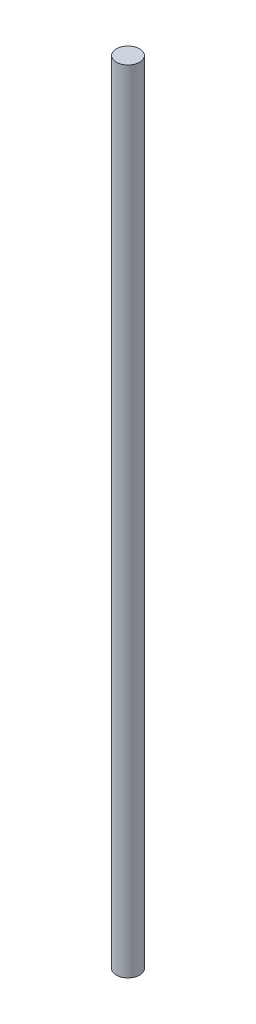
ISO-10303-21;
HEADER;
FILE_DESCRIPTION(('STEP AP214'),'2;1');
FILE_NAME('part.step','',(''),(''),'','','');
FILE_SCHEMA(('AUTOMOTIVE_DESIGN { 1 0 10303 214 1 1 1 1 }'));
ENDSEC;
DATA;
#1=APPLICATION_CONTEXT('core data for automotive mechanical design processes');
#2=APPLICATION_PROTOCOL_DEFINITION('international standard','automotive_design',2000,#1);
#3=PRODUCT_CONTEXT('',#1,'mechanical');
#4=PRODUCT('Part','Part','',(#3));
#5=PRODUCT_RELATED_PRODUCT_CATEGORY('part','',(#4));
#6=PRODUCT_DEFINITION_FORMATION('','',#4);
#7=PRODUCT_DEFINITION_CONTEXT('part definition',#1,'design');
#8=PRODUCT_DEFINITION('design','',#6,#7);
#9=PRODUCT_DEFINITION_SHAPE('','',#8);
#10=(LENGTH_UNIT() NAMED_UNIT(*) SI_UNIT(.MILLI.,.METRE.));
#11=(NAMED_UNIT(*) PLANE_ANGLE_UNIT() SI_UNIT($,.RADIAN.));
#12=(NAMED_UNIT(*) SI_UNIT($,.STERADIAN.) SOLID_ANGLE_UNIT());
#13=UNCERTAINTY_MEASURE_WITH_UNIT(LENGTH_MEASURE(1.E-05),#10,'distance_accuracy_value','');
#14=(GEOMETRIC_REPRESENTATION_CONTEXT(3) GLOBAL_UNCERTAINTY_ASSIGNED_CONTEXT((#13)) GLOBAL_UNIT_ASSIGNED_CONTEXT((#10,
#11,#12)) REPRESENTATION_CONTEXT('',''));
#15=CARTESIAN_POINT('',(0.,0.,0.));
#16=DIRECTION('',(0.,0.,1.));
#17=DIRECTION('',(1.,0.,0.));
#18=AXIS2_PLACEMENT_3D('',#15,#16,#17);
#19=CARTESIAN_POINT('',(0.,340.,0.));
#20=DIRECTION('',(0.,-1.,0.));
#21=DIRECTION('',(0.,0.,-1.));
#22=AXIS2_PLACEMENT_3D('',#19,#20,#21);
#23=CYLINDRICAL_SURFACE('',#22,5.);
#24=CARTESIAN_POINT('',(0.,340.,0.));
#25=DIRECTION('',(0.,1.,0.));
#26=DIRECTION('',(0.,0.,1.));
#27=AXIS2_PLACEMENT_3D('',#24,#25,#26);
#28=CIRCLE('',#27,5.);
#29=CARTESIAN_POINT('',(0.,340.,5.));
#30=VERTEX_POINT('',#29);
#31=EDGE_CURVE('E10',#30,#30,#28,.T.);
#32=ORIENTED_EDGE('',*,*,#31,.F.);
#33=EDGE_LOOP('',(#32));
#34=FACE_BOUND('',#33,.T.);
#35=CARTESIAN_POINT('',(0.,0.,0.));
#36=DIRECTION('',(0.,1.,0.));
#37=DIRECTION('',(0.,0.,1.));
#38=AXIS2_PLACEMENT_3D('',#35,#36,#37);
#39=CIRCLE('',#38,5.);
#40=CARTESIAN_POINT('',(0.,0.,5.));
#41=VERTEX_POINT('',#40);
#42=EDGE_CURVE('E34',#41,#41,#39,.T.);
#43=ORIENTED_EDGE('',*,*,#42,.T.);
#44=EDGE_LOOP('',(#43));
#45=FACE_BOUND('',#44,.T.);
#46=ADVANCED_FACE('F31',(#34,#45),#23,.T.);
#47=CARTESIAN_POINT('',(0.,340.,0.));
#48=DIRECTION('',(0.,1.,0.));
#49=DIRECTION('',(0.,0.,1.));
#50=AXIS2_PLACEMENT_3D('',#47,#48,#49);
#51=PLANE('',#50);
#52=ORIENTED_EDGE('',*,*,#31,.T.);
#53=EDGE_LOOP('',(#52));
#54=FACE_BOUND('',#53,.T.);
#55=ADVANCED_FACE('F46',(#54),#51,.T.);
#56=CARTESIAN_POINT('',(0.,0.,0.));
#57=DIRECTION('',(0.,1.,0.));
#58=DIRECTION('',(0.,0.,1.));
#59=AXIS2_PLACEMENT_3D('',#56,#57,#58);
#60=PLANE('',#59);
#61=ORIENTED_EDGE('',*,*,#42,.F.);
#62=EDGE_LOOP('',(#61));
#63=FACE_BOUND('',#62,.T.);
#64=ADVANCED_FACE('F44',(#63),#60,.F.);
#65=CLOSED_SHELL('',(#46,#55,#64));
#66=MANIFOLD_SOLID_BREP('B2',#65);
#67=ADVANCED_BREP_SHAPE_REPRESENTATION('',(#18,#66),#14);
#68=SHAPE_DEFINITION_REPRESENTATION(#9,#67);
ENDSEC;
END-ISO-10303-21;
